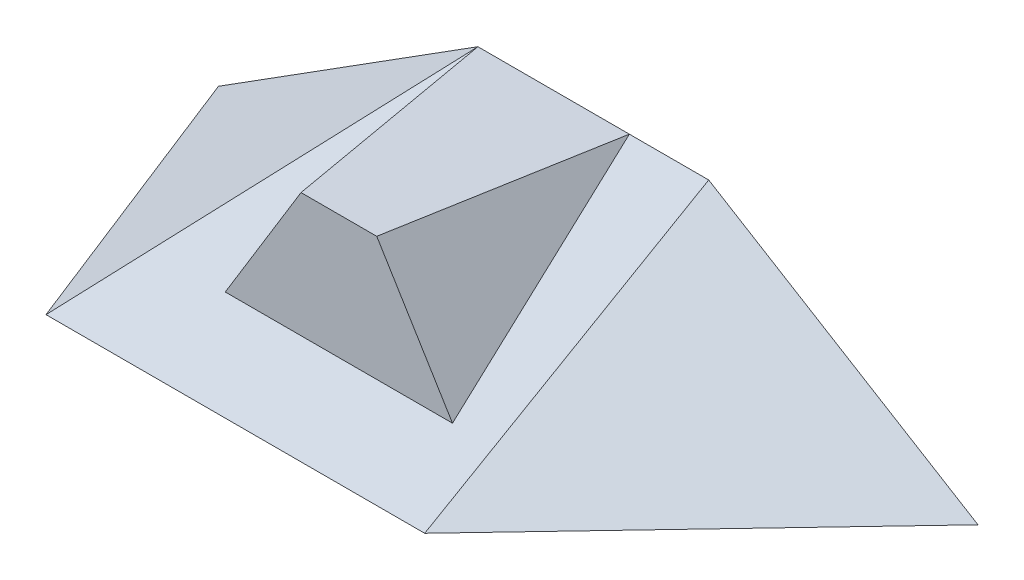
ISO-10303-21;
HEADER;
FILE_DESCRIPTION(('STEP AP214'),'2;1');
FILE_NAME('part.step','',(''),(''),'','','');
FILE_SCHEMA(('AUTOMOTIVE_DESIGN { 1 0 10303 214 1 1 1 1 }'));
ENDSEC;
DATA;
#1=APPLICATION_CONTEXT('core data for automotive mechanical design processes');
#2=APPLICATION_PROTOCOL_DEFINITION('international standard','automotive_design',2000,#1);
#3=PRODUCT_CONTEXT('',#1,'mechanical');
#4=PRODUCT('Part','Part','',(#3));
#5=PRODUCT_RELATED_PRODUCT_CATEGORY('part','',(#4));
#6=PRODUCT_DEFINITION_FORMATION('','',#4);
#7=PRODUCT_DEFINITION_CONTEXT('part definition',#1,'design');
#8=PRODUCT_DEFINITION('design','',#6,#7);
#9=PRODUCT_DEFINITION_SHAPE('','',#8);
#10=(LENGTH_UNIT() NAMED_UNIT(*) SI_UNIT(.MILLI.,.METRE.));
#11=(NAMED_UNIT(*) PLANE_ANGLE_UNIT() SI_UNIT($,.RADIAN.));
#12=(NAMED_UNIT(*) SI_UNIT($,.STERADIAN.) SOLID_ANGLE_UNIT());
#13=UNCERTAINTY_MEASURE_WITH_UNIT(LENGTH_MEASURE(1.E-05),#10,'distance_accuracy_value','');
#14=(GEOMETRIC_REPRESENTATION_CONTEXT(3) GLOBAL_UNCERTAINTY_ASSIGNED_CONTEXT((#13)) GLOBAL_UNIT_ASSIGNED_CONTEXT((#10,
#11,#12)) REPRESENTATION_CONTEXT('',''));
#15=CARTESIAN_POINT('',(0.,0.,0.));
#16=DIRECTION('',(0.,0.,1.));
#17=DIRECTION('',(1.,0.,0.));
#18=AXIS2_PLACEMENT_3D('',#15,#16,#17);
#19=CARTESIAN_POINT('',(100.,43.3,-75.));
#20=DIRECTION('',(0.,0.,1.));
#21=DIRECTION('',(1.,0.,0.));
#22=AXIS2_PLACEMENT_3D('',#19,#20,#21);
#23=PLANE('',#22);
#24=DIRECTION('',(-1.,0.,0.));
#25=VECTOR('',#24,1.);
#26=CARTESIAN_POINT('',(100.,0.,-75.));
#27=LINE('',#26,#25);
#28=CARTESIAN_POINT('',(100.,0.,-75.));
#29=VERTEX_POINT('',#28);
#30=CARTESIAN_POINT('',(39.05,0.,-75.));
#31=VERTEX_POINT('',#30);
#32=EDGE_CURVE('E59',#29,#31,#27,.T.);
#33=ORIENTED_EDGE('',*,*,#32,.T.);
#34=DIRECTION('',(-1.,0.,0.));
#35=VECTOR('',#34,1.);
#36=CARTESIAN_POINT('',(39.05,0.,-75.));
#37=LINE('',#36,#35);
#38=CARTESIAN_POINT('',(-29.46,0.,-74.9999999999999));
#39=VERTEX_POINT('',#38);
#40=EDGE_CURVE('E202',#31,#39,#37,.T.);
#41=ORIENTED_EDGE('',*,*,#40,.T.);
#42=DIRECTION('',(-0.845318807108855,-0.534262214973193,0.));
#43=VECTOR('',#42,1.);
#44=CARTESIAN_POINT('',(4.79499999999999,21.65,-74.9999999999999));
#45=LINE('',#44,#43);
#46=CARTESIAN_POINT('',(39.05,43.3,-75.));
#47=VERTEX_POINT('',#46);
#48=EDGE_CURVE('E154',#47,#39,#45,.T.);
#49=ORIENTED_EDGE('',*,*,#48,.F.);
#50=DIRECTION('',(-1.,0.,0.));
#51=VECTOR('',#50,1.);
#52=CARTESIAN_POINT('',(39.05,43.3,-75.));
#53=LINE('',#52,#51);
#54=CARTESIAN_POINT('',(79.0490061519537,43.3,-74.9999999999999));
#55=VERTEX_POINT('',#54);
#56=EDGE_CURVE('E440',#55,#47,#53,.T.);
#57=ORIENTED_EDGE('',*,*,#56,.F.);
#58=DIRECTION('',(-1.,0.,0.));
#59=VECTOR('',#58,1.);
#60=CARTESIAN_POINT('',(100.,43.3,-75.));
#61=LINE('',#60,#59);
#62=CARTESIAN_POINT('',(100.,43.3,-75.));
#63=VERTEX_POINT('',#62);
#64=EDGE_CURVE('E12',#63,#55,#61,.T.);
#65=ORIENTED_EDGE('',*,*,#64,.F.);
#66=DIRECTION('',(-0.854115046186389,0.520084116156246,0.));
#67=VECTOR('',#66,1.);
#68=CARTESIAN_POINT('',(135.555,21.65,-75.));
#69=LINE('',#68,#67);
#70=CARTESIAN_POINT('',(171.11,0.,-75.));
#71=VERTEX_POINT('',#70);
#72=EDGE_CURVE('E91',#71,#63,#69,.T.);
#73=ORIENTED_EDGE('',*,*,#72,.F.);
#74=DIRECTION('',(-1.,0.,0.));
#75=VECTOR('',#74,1.);
#76=CARTESIAN_POINT('',(100.,0.,-75.));
#77=LINE('',#76,#75);
#78=EDGE_CURVE('E266',#71,#29,#77,.T.);
#79=ORIENTED_EDGE('',*,*,#78,.T.);
#80=EDGE_LOOP('',(#33,#41,#49,#57,#65,#73,#79));
#81=FACE_BOUND('',#80,.T.);
#82=ADVANCED_FACE('F49',(#81),#23,.F.);
#83=CARTESIAN_POINT('',(0.,0.,0.));
#84=DIRECTION('',(0.,1.,0.));
#85=DIRECTION('',(0.,0.,1.));
#86=AXIS2_PLACEMENT_3D('',#83,#84,#85);
#87=PLANE('',#86);
#88=DIRECTION('',(1.,0.,0.));
#89=VECTOR('',#88,1.);
#90=CARTESIAN_POINT('',(0.,0.,0.));
#91=LINE('',#90,#89);
#92=CARTESIAN_POINT('',(0.,0.,0.));
#93=VERTEX_POINT('',#92);
#94=CARTESIAN_POINT('',(100.,0.,0.));
#95=VERTEX_POINT('',#94);
#96=EDGE_CURVE('E275',#93,#95,#91,.T.);
#97=ORIENTED_EDGE('',*,*,#96,.F.);
#98=DIRECTION('',(0.365606296308894,0.,0.930769593454413));
#99=VECTOR('',#98,1.);
#100=CARTESIAN_POINT('',(-29.46,0.,-74.9999999999999));
#101=LINE('',#100,#99);
#102=EDGE_CURVE('E156',#39,#93,#101,.T.);
#103=ORIENTED_EDGE('',*,*,#102,.F.);
#104=ORIENTED_EDGE('',*,*,#40,.F.);
#105=ORIENTED_EDGE('',*,*,#32,.F.);
#106=ORIENTED_EDGE('',*,*,#78,.F.);
#107=DIRECTION('',(0.688037122281483,0.,-0.725675491085799));
#108=VECTOR('',#107,1.);
#109=CARTESIAN_POINT('',(171.11,0.,-75.));
#110=LINE('',#109,#108);
#111=EDGE_CURVE('E274',#95,#71,#110,.T.);
#112=ORIENTED_EDGE('',*,*,#111,.F.);
#113=EDGE_LOOP('',(#97,#103,#104,#105,#106,#112));
#114=FACE_BOUND('',#113,.T.);
#115=ADVANCED_FACE('F238',(#114),#87,.F.);
#116=CARTESIAN_POINT('',(0.,0.,0.));
#117=DIRECTION('',(0.,-0.86603175470726,-0.499988999717658));
#118=DIRECTION('',(0.,0.499988999717658,-0.86603175470726));
#119=AXIS2_PLACEMENT_3D('',#116,#117,#118);
#120=PLANE('',#119);
#121=DIRECTION('',(1.,0.,0.));
#122=VECTOR('',#121,1.);
#123=CARTESIAN_POINT('',(49.0495030759769,10.5594266666666,-18.29));
#124=LINE('',#123,#122);
#125=CARTESIAN_POINT('',(49.0495030759769,10.5594266666666,-18.29));
#126=VERTEX_POINT('',#125);
#127=CARTESIAN_POINT('',(69.0495030759769,10.5594266666666,-18.29));
#128=VERTEX_POINT('',#127);
#129=EDGE_CURVE('E142',#126,#128,#124,.T.);
#130=ORIENTED_EDGE('',*,*,#129,.F.);
#131=DIRECTION('',(1.,0.,0.));
#132=VECTOR('',#131,1.);
#133=CARTESIAN_POINT('',(29.0495030759769,10.5594266666666,-18.29));
#134=LINE('',#133,#132);
#135=CARTESIAN_POINT('',(29.0495030759769,10.5594266666666,-18.29));
#136=VERTEX_POINT('',#135);
#137=EDGE_CURVE('E131',#136,#126,#134,.T.);
#138=ORIENTED_EDGE('',*,*,#137,.F.);
#139=DIRECTION('',(-0.150969529449339,-0.494258334119507,0.856105659560346));
#140=VECTOR('',#139,1.);
#141=CARTESIAN_POINT('',(39.05,43.3,-75.));
#142=LINE('',#141,#140);
#143=EDGE_CURVE('E121',#47,#136,#142,.T.);
#144=ORIENTED_EDGE('',*,*,#143,.F.);
#145=DIRECTION('',(0.411057357057721,0.45579471345965,-0.789482760034035));
#146=VECTOR('',#145,1.);
#147=CARTESIAN_POINT('',(0.,0.,0.));
#148=LINE('',#147,#146);
#149=EDGE_CURVE('E75',#93,#47,#148,.T.);
#150=ORIENTED_EDGE('',*,*,#149,.F.);
#151=ORIENTED_EDGE('',*,*,#96,.T.);
#152=DIRECTION('',(0.,0.499988999717658,-0.86603175470726));
#153=VECTOR('',#152,1.);
#154=CARTESIAN_POINT('',(100.,0.,0.));
#155=LINE('',#154,#153);
#156=EDGE_CURVE('E83',#95,#63,#155,.T.);
#157=ORIENTED_EDGE('',*,*,#156,.T.);
#158=ORIENTED_EDGE('',*,*,#64,.T.);
#159=DIRECTION('',(-0.15096952944934,0.494258334119507,-0.856105659560346));
#160=VECTOR('',#159,1.);
#161=CARTESIAN_POINT('',(89.0495030759769,10.5594266666666,-18.29));
#162=LINE('',#161,#160);
#163=CARTESIAN_POINT('',(89.0495030759769,10.5594266666666,-18.29));
#164=VERTEX_POINT('',#163);
#165=EDGE_CURVE('E433',#164,#55,#162,.T.);
#166=ORIENTED_EDGE('',*,*,#165,.F.);
#167=DIRECTION('',(1.,0.,0.));
#168=VECTOR('',#167,1.);
#169=CARTESIAN_POINT('',(69.0495030759769,10.5594266666666,-18.29));
#170=LINE('',#169,#168);
#171=EDGE_CURVE('E67',#128,#164,#170,.T.);
#172=ORIENTED_EDGE('',*,*,#171,.F.);
#173=EDGE_LOOP('',(#130,#138,#144,#150,#151,#157,#158,#166,#172));
#174=FACE_BOUND('',#173,.T.);
#175=ADVANCED_FACE('F141',(#174),#120,.F.);
#176=CARTESIAN_POINT('',(100.,0.,0.));
#177=DIRECTION('',(0.466455990838616,0.766043545231732,0.44226247344712));
#178=DIRECTION('',(0.688037122281483,0.,-0.725675491085799));
#179=AXIS2_PLACEMENT_3D('',#176,#177,#178);
#180=PLANE('',#179);
#181=ORIENTED_EDGE('',*,*,#111,.T.);
#182=ORIENTED_EDGE('',*,*,#72,.T.);
#183=ORIENTED_EDGE('',*,*,#156,.F.);
#184=EDGE_LOOP('',(#181,#182,#183));
#185=FACE_BOUND('',#184,.T.);
#186=ADVANCED_FACE('F183',(#185),#180,.T.);
#187=CARTESIAN_POINT('',(-29.46,0.,-74.9999999999999));
#188=DIRECTION('',(-0.522872492627152,0.827297793761806,0.205384315103946));
#189=DIRECTION('',(0.365606296308894,0.,0.930769593454413));
#190=AXIS2_PLACEMENT_3D('',#187,#188,#189);
#191=PLANE('',#190);
#192=ORIENTED_EDGE('',*,*,#102,.T.);
#193=ORIENTED_EDGE('',*,*,#149,.T.);
#194=ORIENTED_EDGE('',*,*,#48,.T.);
#195=EDGE_LOOP('',(#192,#193,#194));
#196=FACE_BOUND('',#195,.T.);
#197=ADVANCED_FACE('F173',(#196),#191,.T.);
#198=CARTESIAN_POINT('',(79.0490061519537,43.3,-75.));
#199=DIRECTION('',(0.,1.,0.));
#200=DIRECTION('',(0.,0.,1.));
#201=AXIS2_PLACEMENT_3D('',#198,#199,#200);
#202=PLANE('',#201);
#203=ORIENTED_EDGE('',*,*,#56,.T.);
#204=CARTESIAN_POINT('',(39.05,43.3,-75.));
#205=DIRECTION('',(0.173648177666927,0.,0.984807753012208));
#206=VECTOR('',#205,1.);
#207=LINE('',#204,#206);
#208=CARTESIAN_POINT('',(49.0495030759769,43.3,-18.29));
#209=VERTEX_POINT('',#208);
#210=EDGE_CURVE('E127',#47,#209,#207,.T.);
#211=ORIENTED_EDGE('',*,*,#210,.T.);
#212=DIRECTION('',(1.,0.,0.));
#213=VECTOR('',#212,1.);
#214=CARTESIAN_POINT('',(49.0495030759769,43.3,-18.29));
#215=LINE('',#214,#213);
#216=CARTESIAN_POINT('',(69.0495030759769,43.3,-18.29));
#217=VERTEX_POINT('',#216);
#218=EDGE_CURVE('E138',#209,#217,#215,.T.);
#219=ORIENTED_EDGE('',*,*,#218,.T.);
#220=CARTESIAN_POINT('',(69.0495030759769,43.3,-18.29));
#221=DIRECTION('',(0.173648177666927,0.,-0.984807753012209));
#222=VECTOR('',#221,1.);
#223=LINE('',#220,#222);
#224=EDGE_CURVE('E426',#217,#55,#223,.T.);
#225=ORIENTED_EDGE('',*,*,#224,.T.);
#226=EDGE_LOOP('',(#203,#211,#219,#225));
#227=FACE_BOUND('',#226,.T.);
#228=ADVANCED_FACE('F182',(#227),#202,.T.);
#229=CARTESIAN_POINT('',(49.0495030759769,-47.8348771155636,-18.29));
#230=DIRECTION('',(0.,0.,1.));
#231=DIRECTION('',(1.,0.,0.));
#232=AXIS2_PLACEMENT_3D('',#229,#230,#231);
#233=PLANE('',#232);
#234=ORIENTED_EDGE('',*,*,#218,.F.);
#235=DIRECTION('',(0.521295748935753,0.853376084819297,0.));
#236=VECTOR('',#235,1.);
#237=CARTESIAN_POINT('',(39.0495030759769,26.9297133333333,-18.29));
#238=LINE('',#237,#236);
#239=EDGE_CURVE('E53',#136,#209,#238,.T.);
#240=ORIENTED_EDGE('',*,*,#239,.F.);
#241=ORIENTED_EDGE('',*,*,#137,.T.);
#242=ORIENTED_EDGE('',*,*,#129,.T.);
#243=ORIENTED_EDGE('',*,*,#171,.T.);
#244=DIRECTION('',(0.521295748935753,-0.853376084819297,0.));
#245=VECTOR('',#244,1.);
#246=CARTESIAN_POINT('',(79.0495030759769,26.9297133333333,-18.29));
#247=LINE('',#246,#245);
#248=EDGE_CURVE('E143',#217,#164,#247,.T.);
#249=ORIENTED_EDGE('',*,*,#248,.F.);
#250=EDGE_LOOP('',(#234,#240,#241,#242,#243,#249));
#251=FACE_BOUND('',#250,.T.);
#252=ADVANCED_FACE('F135',(#251),#233,.T.);
#253=CARTESIAN_POINT('',(89.0495030759769,10.5594266666666,-18.29));
#254=DIRECTION('',(0.843875958793217,0.515492474857833,0.148798099906466));
#255=DIRECTION('',(-0.15096952944934,0.494258334119507,-0.856105659560346));
#256=AXIS2_PLACEMENT_3D('',#253,#254,#255);
#257=PLANE('',#256);
#258=ORIENTED_EDGE('',*,*,#165,.T.);
#259=ORIENTED_EDGE('',*,*,#224,.F.);
#260=ORIENTED_EDGE('',*,*,#248,.T.);
#261=EDGE_LOOP('',(#258,#259,#260));
#262=FACE_BOUND('',#261,.T.);
#263=ADVANCED_FACE('F327',(#262),#257,.T.);
#264=CARTESIAN_POINT('',(39.05,43.3,-75.));
#265=DIRECTION('',(-0.843875958793217,0.515492474857833,0.148798099906467));
#266=DIRECTION('',(-0.150969529449339,-0.494258334119507,0.856105659560346));
#267=AXIS2_PLACEMENT_3D('',#264,#265,#266);
#268=PLANE('',#267);
#269=ORIENTED_EDGE('',*,*,#143,.T.);
#270=ORIENTED_EDGE('',*,*,#239,.T.);
#271=ORIENTED_EDGE('',*,*,#210,.F.);
#272=EDGE_LOOP('',(#269,#270,#271));
#273=FACE_BOUND('',#272,.T.);
#274=ADVANCED_FACE('F123',(#273),#268,.T.);
#275=CLOSED_SHELL('',(#82,#115,#175,#186,#197,#228,#252,#263,#274));
#276=MANIFOLD_SOLID_BREP('B2',#275);
#277=ADVANCED_BREP_SHAPE_REPRESENTATION('',(#18,#276),#14);
#278=SHAPE_DEFINITION_REPRESENTATION(#9,#277);
ENDSEC;
END-ISO-10303-21;
